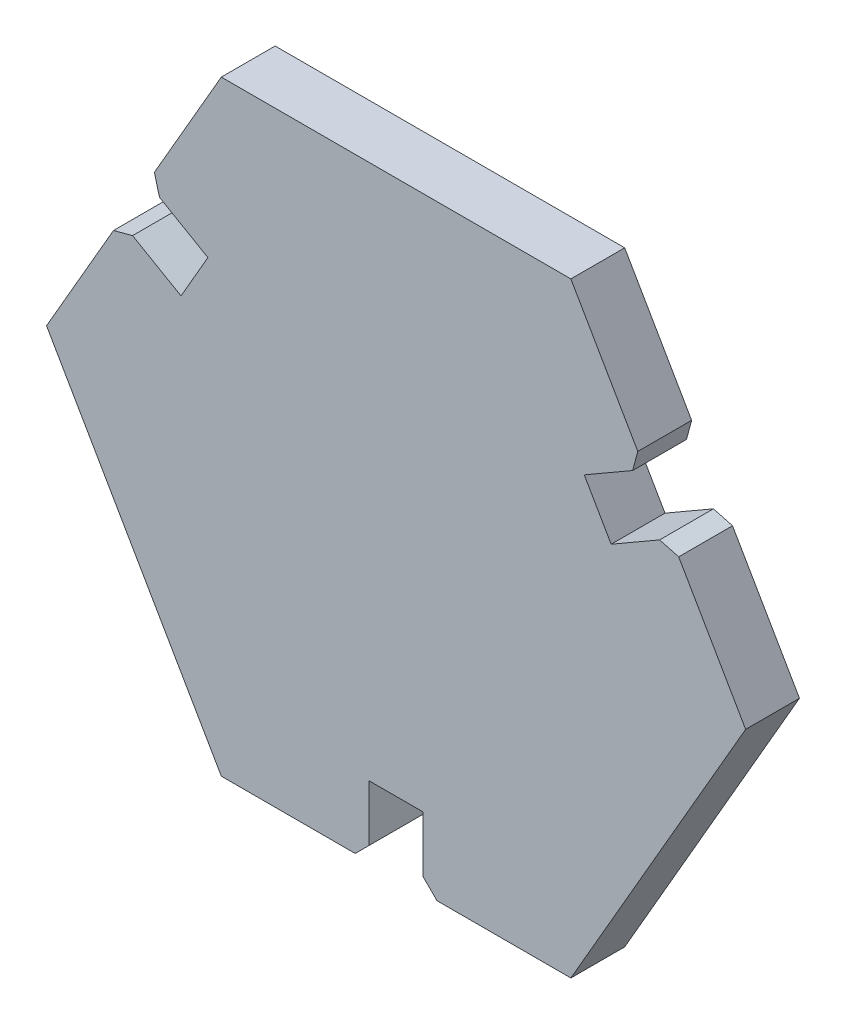
ISO-10303-21;
HEADER;
FILE_DESCRIPTION(('STEP AP214'),'2;1');
FILE_NAME('part.step','',(''),(''),'','','');
FILE_SCHEMA(('AUTOMOTIVE_DESIGN { 1 0 10303 214 1 1 1 1 }'));
ENDSEC;
DATA;
#1=APPLICATION_CONTEXT('core data for automotive mechanical design processes');
#2=APPLICATION_PROTOCOL_DEFINITION('international standard','automotive_design',2000,#1);
#3=PRODUCT_CONTEXT('',#1,'mechanical');
#4=PRODUCT('Part','Part','',(#3));
#5=PRODUCT_RELATED_PRODUCT_CATEGORY('part','',(#4));
#6=PRODUCT_DEFINITION_FORMATION('','',#4);
#7=PRODUCT_DEFINITION_CONTEXT('part definition',#1,'design');
#8=PRODUCT_DEFINITION('design','',#6,#7);
#9=PRODUCT_DEFINITION_SHAPE('','',#8);
#10=(LENGTH_UNIT() NAMED_UNIT(*) SI_UNIT(.MILLI.,.METRE.));
#11=(NAMED_UNIT(*) PLANE_ANGLE_UNIT() SI_UNIT($,.RADIAN.));
#12=(NAMED_UNIT(*) SI_UNIT($,.STERADIAN.) SOLID_ANGLE_UNIT());
#13=UNCERTAINTY_MEASURE_WITH_UNIT(LENGTH_MEASURE(1.E-05),#10,'distance_accuracy_value','');
#14=(GEOMETRIC_REPRESENTATION_CONTEXT(3) GLOBAL_UNCERTAINTY_ASSIGNED_CONTEXT((#13)) GLOBAL_UNIT_ASSIGNED_CONTEXT((#10,
#11,#12)) REPRESENTATION_CONTEXT('',''));
#15=CARTESIAN_POINT('',(0.,0.,0.));
#16=DIRECTION('',(0.,0.,1.));
#17=DIRECTION('',(1.,0.,0.));
#18=AXIS2_PLACEMENT_3D('',#15,#16,#17);
#19=CARTESIAN_POINT('',(12.5,-21.6506350946109,3.85));
#20=DIRECTION('',(-0.866025403784438,0.500000000000002,0.));
#21=DIRECTION('',(-0.500000000000002,-0.866025403784438,0.));
#22=AXIS2_PLACEMENT_3D('',#19,#20,#21);
#23=PLANE('',#22);
#24=DIRECTION('',(0.500000000000001,0.866025403784438,0.));
#25=VECTOR('',#24,1.);
#26=CARTESIAN_POINT('',(12.5,-21.6506350946109,0.));
#27=LINE('',#26,#25);
#28=CARTESIAN_POINT('',(12.5,-21.6506350946109,0.));
#29=VERTEX_POINT('',#28);
#30=CARTESIAN_POINT('',(25.,0.,0.));
#31=VERTEX_POINT('',#30);
#32=EDGE_CURVE('E219',#29,#31,#27,.T.);
#33=ORIENTED_EDGE('',*,*,#32,.T.);
#34=DIRECTION('',(0.,0.,-1.));
#35=VECTOR('',#34,1.);
#36=CARTESIAN_POINT('',(25.,0.,3.85));
#37=LINE('',#36,#35);
#38=CARTESIAN_POINT('',(25.,0.,3.85));
#39=VERTEX_POINT('',#38);
#40=EDGE_CURVE('E200',#39,#31,#37,.T.);
#41=ORIENTED_EDGE('',*,*,#40,.F.);
#42=DIRECTION('',(0.500000000000001,0.866025403784438,0.));
#43=VECTOR('',#42,1.);
#44=CARTESIAN_POINT('',(12.5,-21.6506350946109,3.85));
#45=LINE('',#44,#43);
#46=CARTESIAN_POINT('',(12.5,-21.6506350946109,3.85));
#47=VERTEX_POINT('',#46);
#48=EDGE_CURVE('E206',#47,#39,#45,.T.);
#49=ORIENTED_EDGE('',*,*,#48,.F.);
#50=DIRECTION('',(0.,0.,-1.));
#51=VECTOR('',#50,1.);
#52=CARTESIAN_POINT('',(12.5,-21.6506350946109,3.85));
#53=LINE('',#52,#51);
#54=EDGE_CURVE('E323',#47,#29,#53,.T.);
#55=ORIENTED_EDGE('',*,*,#54,.T.);
#56=EDGE_LOOP('',(#33,#41,#49,#55));
#57=FACE_BOUND('',#56,.T.);
#58=ADVANCED_FACE('F33',(#57),#23,.F.);
#59=CARTESIAN_POINT('',(25.,0.,3.85));
#60=DIRECTION('',(-0.866025403784439,-0.5,0.));
#61=DIRECTION('',(0.5,-0.866025403784439,0.));
#62=AXIS2_PLACEMENT_3D('',#59,#60,#61);
#63=PLANE('',#62);
#64=DIRECTION('',(-0.5,0.866025403784439,0.));
#65=VECTOR('',#64,1.);
#66=CARTESIAN_POINT('',(25.,0.,0.));
#67=LINE('',#66,#65);
#68=CARTESIAN_POINT('',(20.2125,8.29219324123599,0.));
#69=VERTEX_POINT('',#68);
#70=EDGE_CURVE('E360',#31,#69,#67,.T.);
#71=ORIENTED_EDGE('',*,*,#70,.T.);
#72=DIRECTION('',(0.,0.,1.));
#73=VECTOR('',#72,1.);
#74=CARTESIAN_POINT('',(20.2125,8.292193241236,3.85));
#75=LINE('',#74,#73);
#76=CARTESIAN_POINT('',(20.2125,8.29219324123599,3.85));
#77=VERTEX_POINT('',#76);
#78=EDGE_CURVE('E203',#69,#77,#75,.T.);
#79=ORIENTED_EDGE('',*,*,#78,.T.);
#80=DIRECTION('',(-0.5,0.866025403784439,0.));
#81=VECTOR('',#80,1.);
#82=CARTESIAN_POINT('',(25.,0.,3.85));
#83=LINE('',#82,#81);
#84=EDGE_CURVE('E195',#39,#77,#83,.T.);
#85=ORIENTED_EDGE('',*,*,#84,.F.);
#86=ORIENTED_EDGE('',*,*,#40,.T.);
#87=EDGE_LOOP('',(#71,#79,#85,#86));
#88=FACE_BOUND('',#87,.T.);
#89=ADVANCED_FACE('F198',(#88),#63,.F.);
#90=CARTESIAN_POINT('',(19.7125,9.15821864502044,3.85));
#91=DIRECTION('',(0.5,-0.866025403784438,0.));
#92=DIRECTION('',(0.866025403784439,0.5,0.));
#93=AXIS2_PLACEMENT_3D('',#90,#91,#92);
#94=PLANE('',#93);
#95=DIRECTION('',(-0.866025403784438,-0.5,0.));
#96=VECTOR('',#95,1.);
#97=CARTESIAN_POINT('',(19.7125,9.15821864502044,3.85));
#98=LINE('',#97,#96);
#99=CARTESIAN_POINT('',(18.8464745962156,8.65821864502044,3.85));
#100=VERTEX_POINT('',#99);
#101=CARTESIAN_POINT('',(15.3823729810778,6.65821864502044,3.85));
#102=VERTEX_POINT('',#101);
#103=EDGE_CURVE('E205',#100,#102,#98,.T.);
#104=ORIENTED_EDGE('',*,*,#103,.F.);
#105=DIRECTION('',(0.,0.,-1.));
#106=VECTOR('',#105,1.);
#107=CARTESIAN_POINT('',(18.8464745962156,8.65821864502044,3.85));
#108=LINE('',#107,#106);
#109=CARTESIAN_POINT('',(18.8464745962156,8.65821864502044,0.));
#110=VERTEX_POINT('',#109);
#111=EDGE_CURVE('E269',#100,#110,#108,.T.);
#112=ORIENTED_EDGE('',*,*,#111,.T.);
#113=DIRECTION('',(-0.866025403784438,-0.5,0.));
#114=VECTOR('',#113,1.);
#115=CARTESIAN_POINT('',(19.7125,9.15821864502044,0.));
#116=LINE('',#115,#114);
#117=CARTESIAN_POINT('',(15.3823729810778,6.65821864502044,0.));
#118=VERTEX_POINT('',#117);
#119=EDGE_CURVE('E359',#110,#118,#116,.T.);
#120=ORIENTED_EDGE('',*,*,#119,.T.);
#121=DIRECTION('',(0.,0.,-1.));
#122=VECTOR('',#121,1.);
#123=CARTESIAN_POINT('',(15.3823729810778,6.65821864502044,3.85));
#124=LINE('',#123,#122);
#125=EDGE_CURVE('E221',#102,#118,#124,.T.);
#126=ORIENTED_EDGE('',*,*,#125,.F.);
#127=EDGE_LOOP('',(#104,#112,#120,#126));
#128=FACE_BOUND('',#127,.T.);
#129=ADVANCED_FACE('F398',(#128),#94,.F.);
#130=CARTESIAN_POINT('',(13.4573729810778,9.99241644959053,3.85));
#131=DIRECTION('',(-0.866025403784439,-0.5,0.));
#132=DIRECTION('',(0.5,-0.866025403784439,0.));
#133=AXIS2_PLACEMENT_3D('',#130,#131,#132);
#134=PLANE('',#133);
#135=DIRECTION('',(-0.5,0.866025403784439,0.));
#136=VECTOR('',#135,1.);
#137=CARTESIAN_POINT('',(13.4573729810778,9.99241644959053,0.));
#138=LINE('',#137,#136);
#139=CARTESIAN_POINT('',(13.4573729810778,9.99241644959053,0.));
#140=VERTEX_POINT('',#139);
#141=EDGE_CURVE('E296',#118,#140,#138,.T.);
#142=ORIENTED_EDGE('',*,*,#141,.T.);
#143=DIRECTION('',(0.,0.,-1.));
#144=VECTOR('',#143,1.);
#145=CARTESIAN_POINT('',(13.4573729810778,9.99241644959053,3.85));
#146=LINE('',#145,#144);
#147=CARTESIAN_POINT('',(13.4573729810778,9.99241644959053,3.85));
#148=VERTEX_POINT('',#147);
#149=EDGE_CURVE('E227',#148,#140,#146,.T.);
#150=ORIENTED_EDGE('',*,*,#149,.F.);
#151=DIRECTION('',(-0.5,0.866025403784439,0.));
#152=VECTOR('',#151,1.);
#153=CARTESIAN_POINT('',(13.4573729810778,9.99241644959053,3.85));
#154=LINE('',#153,#152);
#155=EDGE_CURVE('E392',#102,#148,#154,.T.);
#156=ORIENTED_EDGE('',*,*,#155,.F.);
#157=ORIENTED_EDGE('',*,*,#125,.T.);
#158=EDGE_LOOP('',(#142,#150,#156,#157));
#159=FACE_BOUND('',#158,.T.);
#160=ADVANCED_FACE('F399',(#159),#134,.F.);
#161=CARTESIAN_POINT('',(17.7875,12.4924164495905,3.85));
#162=DIRECTION('',(-0.5,0.866025403784439,0.));
#163=DIRECTION('',(-0.866025403784439,-0.5,0.));
#164=AXIS2_PLACEMENT_3D('',#161,#162,#163);
#165=PLANE('',#164);
#166=DIRECTION('',(0.866025403784439,0.5,0.));
#167=VECTOR('',#166,1.);
#168=CARTESIAN_POINT('',(17.7875,12.4924164495905,0.));
#169=LINE('',#168,#167);
#170=CARTESIAN_POINT('',(16.9214745962156,11.9924164495905,0.));
#171=VERTEX_POINT('',#170);
#172=EDGE_CURVE('E292',#140,#171,#169,.T.);
#173=ORIENTED_EDGE('',*,*,#172,.T.);
#174=DIRECTION('',(0.,0.,1.));
#175=VECTOR('',#174,1.);
#176=CARTESIAN_POINT('',(16.9214745962156,11.9924164495905,3.85));
#177=LINE('',#176,#175);
#178=CARTESIAN_POINT('',(16.9214745962156,11.9924164495905,3.85));
#179=VERTEX_POINT('',#178);
#180=EDGE_CURVE('E11',#171,#179,#177,.T.);
#181=ORIENTED_EDGE('',*,*,#180,.T.);
#182=DIRECTION('',(0.866025403784439,0.5,0.));
#183=VECTOR('',#182,1.);
#184=CARTESIAN_POINT('',(17.7875,12.4924164495905,3.85));
#185=LINE('',#184,#183);
#186=EDGE_CURVE('E354',#148,#179,#185,.T.);
#187=ORIENTED_EDGE('',*,*,#186,.F.);
#188=ORIENTED_EDGE('',*,*,#149,.T.);
#189=EDGE_LOOP('',(#173,#181,#187,#188));
#190=FACE_BOUND('',#189,.T.);
#191=ADVANCED_FACE('F351',(#190),#165,.F.);
#192=CARTESIAN_POINT('',(12.5,21.650635094611,3.85));
#193=DIRECTION('',(-0.866025403784437,-0.500000000000002,0.));
#194=DIRECTION('',(0.500000000000002,-0.866025403784437,0.));
#195=AXIS2_PLACEMENT_3D('',#192,#193,#194);
#196=PLANE('',#195);
#197=DIRECTION('',(-0.500000000000002,0.866025403784437,0.));
#198=VECTOR('',#197,1.);
#199=CARTESIAN_POINT('',(12.5,21.650635094611,3.85));
#200=LINE('',#199,#198);
#201=CARTESIAN_POINT('',(17.2875,13.358441853375,3.85));
#202=VERTEX_POINT('',#201);
#203=CARTESIAN_POINT('',(12.5,21.650635094611,3.85));
#204=VERTEX_POINT('',#203);
#205=EDGE_CURVE('E281',#202,#204,#200,.T.);
#206=ORIENTED_EDGE('',*,*,#205,.F.);
#207=DIRECTION('',(0.,0.,-1.));
#208=VECTOR('',#207,1.);
#209=CARTESIAN_POINT('',(17.2875,13.358441853375,3.85));
#210=LINE('',#209,#208);
#211=CARTESIAN_POINT('',(17.2875,13.358441853375,0.));
#212=VERTEX_POINT('',#211);
#213=EDGE_CURVE('E41',#202,#212,#210,.T.);
#214=ORIENTED_EDGE('',*,*,#213,.T.);
#215=DIRECTION('',(-0.500000000000002,0.866025403784437,0.));
#216=VECTOR('',#215,1.);
#217=CARTESIAN_POINT('',(12.5,21.650635094611,0.));
#218=LINE('',#217,#216);
#219=CARTESIAN_POINT('',(12.5,21.650635094611,0.));
#220=VERTEX_POINT('',#219);
#221=EDGE_CURVE('E279',#212,#220,#218,.T.);
#222=ORIENTED_EDGE('',*,*,#221,.T.);
#223=DIRECTION('',(0.,0.,-1.));
#224=VECTOR('',#223,1.);
#225=CARTESIAN_POINT('',(12.5,21.650635094611,3.85));
#226=LINE('',#225,#224);
#227=EDGE_CURVE('E346',#204,#220,#226,.T.);
#228=ORIENTED_EDGE('',*,*,#227,.F.);
#229=EDGE_LOOP('',(#206,#214,#222,#228));
#230=FACE_BOUND('',#229,.T.);
#231=ADVANCED_FACE('F277',(#230),#196,.F.);
#232=CARTESIAN_POINT('',(-12.5,21.6506350946109,3.85));
#233=DIRECTION('',(0.,-1.,0.));
#234=DIRECTION('',(1.,0.,0.));
#235=AXIS2_PLACEMENT_3D('',#232,#233,#234);
#236=PLANE('',#235);
#237=DIRECTION('',(-1.,0.,0.));
#238=VECTOR('',#237,1.);
#239=CARTESIAN_POINT('',(-12.5,21.6506350946109,0.));
#240=LINE('',#239,#238);
#241=CARTESIAN_POINT('',(-12.5,21.6506350946109,0.));
#242=VERTEX_POINT('',#241);
#243=EDGE_CURVE('E291',#220,#242,#240,.T.);
#244=ORIENTED_EDGE('',*,*,#243,.T.);
#245=DIRECTION('',(0.,0.,-1.));
#246=VECTOR('',#245,1.);
#247=CARTESIAN_POINT('',(-12.5,21.6506350946109,3.85));
#248=LINE('',#247,#246);
#249=CARTESIAN_POINT('',(-12.5,21.6506350946109,3.85));
#250=VERTEX_POINT('',#249);
#251=EDGE_CURVE('E343',#250,#242,#248,.T.);
#252=ORIENTED_EDGE('',*,*,#251,.F.);
#253=DIRECTION('',(-1.,0.,0.));
#254=VECTOR('',#253,1.);
#255=CARTESIAN_POINT('',(-12.5,21.6506350946109,3.85));
#256=LINE('',#255,#254);
#257=EDGE_CURVE('E388',#204,#250,#256,.T.);
#258=ORIENTED_EDGE('',*,*,#257,.F.);
#259=ORIENTED_EDGE('',*,*,#227,.T.);
#260=EDGE_LOOP('',(#244,#252,#258,#259));
#261=FACE_BOUND('',#260,.T.);
#262=ADVANCED_FACE('F490',(#261),#236,.F.);
#263=CARTESIAN_POINT('',(-12.5,21.6506350946109,3.85));
#264=DIRECTION('',(0.866025403784438,-0.500000000000001,0.));
#265=DIRECTION('',(0.500000000000001,0.866025403784438,0.));
#266=AXIS2_PLACEMENT_3D('',#263,#264,#265);
#267=PLANE('',#266);
#268=DIRECTION('',(-0.500000000000001,-0.866025403784438,0.));
#269=VECTOR('',#268,1.);
#270=CARTESIAN_POINT('',(-12.5,21.6506350946109,0.));
#271=LINE('',#270,#269);
#272=CARTESIAN_POINT('',(-17.2875,13.358441853375,0.));
#273=VERTEX_POINT('',#272);
#274=EDGE_CURVE('E294',#242,#273,#271,.T.);
#275=ORIENTED_EDGE('',*,*,#274,.T.);
#276=DIRECTION('',(0.,0.,1.));
#277=VECTOR('',#276,1.);
#278=CARTESIAN_POINT('',(-17.2875,13.358441853375,3.85));
#279=LINE('',#278,#277);
#280=CARTESIAN_POINT('',(-17.2875,13.358441853375,3.85));
#281=VERTEX_POINT('',#280);
#282=EDGE_CURVE('E267',#273,#281,#279,.T.);
#283=ORIENTED_EDGE('',*,*,#282,.T.);
#284=DIRECTION('',(-0.500000000000001,-0.866025403784438,0.));
#285=VECTOR('',#284,1.);
#286=CARTESIAN_POINT('',(-12.5,21.6506350946109,3.85));
#287=LINE('',#286,#285);
#288=EDGE_CURVE('E385',#250,#281,#287,.T.);
#289=ORIENTED_EDGE('',*,*,#288,.F.);
#290=ORIENTED_EDGE('',*,*,#251,.T.);
#291=EDGE_LOOP('',(#275,#283,#289,#290));
#292=FACE_BOUND('',#291,.T.);
#293=ADVANCED_FACE('F486',(#292),#267,.F.);
#294=CARTESIAN_POINT('',(-17.7875,12.4924164495905,3.85));
#295=DIRECTION('',(0.499999999999999,0.866025403784439,0.));
#296=DIRECTION('',(-0.866025403784439,0.499999999999999,0.));
#297=AXIS2_PLACEMENT_3D('',#294,#295,#296);
#298=PLANE('',#297);
#299=DIRECTION('',(0.866025403784439,-0.499999999999999,0.));
#300=VECTOR('',#299,1.);
#301=CARTESIAN_POINT('',(-17.7875,12.4924164495905,3.85));
#302=LINE('',#301,#300);
#303=CARTESIAN_POINT('',(-16.9214745962156,11.9924164495905,3.85));
#304=VERTEX_POINT('',#303);
#305=CARTESIAN_POINT('',(-13.4573729810778,9.99241644959054,3.85));
#306=VERTEX_POINT('',#305);
#307=EDGE_CURVE('E383',#304,#306,#302,.T.);
#308=ORIENTED_EDGE('',*,*,#307,.F.);
#309=DIRECTION('',(0.,0.,-1.));
#310=VECTOR('',#309,1.);
#311=CARTESIAN_POINT('',(-16.9214745962156,11.9924164495905,3.85));
#312=LINE('',#311,#310);
#313=CARTESIAN_POINT('',(-16.9214745962156,11.9924164495905,0.));
#314=VERTEX_POINT('',#313);
#315=EDGE_CURVE('E264',#304,#314,#312,.T.);
#316=ORIENTED_EDGE('',*,*,#315,.T.);
#317=DIRECTION('',(0.866025403784439,-0.499999999999999,0.));
#318=VECTOR('',#317,1.);
#319=CARTESIAN_POINT('',(-17.7875,12.4924164495905,0.));
#320=LINE('',#319,#318);
#321=CARTESIAN_POINT('',(-13.4573729810778,9.99241644959054,0.));
#322=VERTEX_POINT('',#321);
#323=EDGE_CURVE('E302',#314,#322,#320,.T.);
#324=ORIENTED_EDGE('',*,*,#323,.T.);
#325=DIRECTION('',(0.,0.,-1.));
#326=VECTOR('',#325,1.);
#327=CARTESIAN_POINT('',(-13.4573729810778,9.99241644959054,3.85));
#328=LINE('',#327,#326);
#329=EDGE_CURVE('E340',#306,#322,#328,.T.);
#330=ORIENTED_EDGE('',*,*,#329,.F.);
#331=EDGE_LOOP('',(#308,#316,#324,#330));
#332=FACE_BOUND('',#331,.T.);
#333=ADVANCED_FACE('F482',(#332),#298,.F.);
#334=CARTESIAN_POINT('',(-15.3823729810778,6.65821864502045,3.85));
#335=DIRECTION('',(0.866025403784439,-0.499999999999999,0.));
#336=DIRECTION('',(0.5,0.866025403784439,0.));
#337=AXIS2_PLACEMENT_3D('',#334,#335,#336);
#338=PLANE('',#337);
#339=DIRECTION('',(-0.5,-0.866025403784439,0.));
#340=VECTOR('',#339,1.);
#341=CARTESIAN_POINT('',(-15.3823729810778,6.65821864502045,0.));
#342=LINE('',#341,#340);
#343=CARTESIAN_POINT('',(-15.3823729810778,6.65821864502045,0.));
#344=VERTEX_POINT('',#343);
#345=EDGE_CURVE('E304',#322,#344,#342,.T.);
#346=ORIENTED_EDGE('',*,*,#345,.T.);
#347=DIRECTION('',(0.,0.,-1.));
#348=VECTOR('',#347,1.);
#349=CARTESIAN_POINT('',(-15.3823729810778,6.65821864502045,3.85));
#350=LINE('',#349,#348);
#351=CARTESIAN_POINT('',(-15.3823729810778,6.65821864502045,3.85));
#352=VERTEX_POINT('',#351);
#353=EDGE_CURVE('E337',#352,#344,#350,.T.);
#354=ORIENTED_EDGE('',*,*,#353,.F.);
#355=DIRECTION('',(-0.5,-0.866025403784439,0.));
#356=VECTOR('',#355,1.);
#357=CARTESIAN_POINT('',(-15.3823729810778,6.65821864502045,3.85));
#358=LINE('',#357,#356);
#359=EDGE_CURVE('E381',#306,#352,#358,.T.);
#360=ORIENTED_EDGE('',*,*,#359,.F.);
#361=ORIENTED_EDGE('',*,*,#329,.T.);
#362=EDGE_LOOP('',(#346,#354,#360,#361));
#363=FACE_BOUND('',#362,.T.);
#364=ADVANCED_FACE('F478',(#363),#338,.F.);
#365=CARTESIAN_POINT('',(-19.7125,9.15821864502045,3.85));
#366=DIRECTION('',(-0.5,-0.866025403784439,0.));
#367=DIRECTION('',(0.866025403784439,-0.5,0.));
#368=AXIS2_PLACEMENT_3D('',#365,#366,#367);
#369=PLANE('',#368);
#370=DIRECTION('',(-0.866025403784439,0.5,0.));
#371=VECTOR('',#370,1.);
#372=CARTESIAN_POINT('',(-19.7125,9.15821864502045,0.));
#373=LINE('',#372,#371);
#374=CARTESIAN_POINT('',(-18.8464745962155,8.65821864502044,0.));
#375=VERTEX_POINT('',#374);
#376=EDGE_CURVE('E306',#344,#375,#373,.T.);
#377=ORIENTED_EDGE('',*,*,#376,.T.);
#378=DIRECTION('',(0.,0.,1.));
#379=VECTOR('',#378,1.);
#380=CARTESIAN_POINT('',(-18.8464745962155,8.65821864502044,3.85));
#381=LINE('',#380,#379);
#382=CARTESIAN_POINT('',(-18.8464745962155,8.65821864502044,3.85));
#383=VERTEX_POINT('',#382);
#384=EDGE_CURVE('E262',#375,#383,#381,.T.);
#385=ORIENTED_EDGE('',*,*,#384,.T.);
#386=DIRECTION('',(-0.866025403784439,0.5,0.));
#387=VECTOR('',#386,1.);
#388=CARTESIAN_POINT('',(-19.7125,9.15821864502045,3.85));
#389=LINE('',#388,#387);
#390=EDGE_CURVE('E378',#352,#383,#389,.T.);
#391=ORIENTED_EDGE('',*,*,#390,.F.);
#392=ORIENTED_EDGE('',*,*,#353,.T.);
#393=EDGE_LOOP('',(#377,#385,#391,#392));
#394=FACE_BOUND('',#393,.T.);
#395=ADVANCED_FACE('F474',(#394),#369,.F.);
#396=CARTESIAN_POINT('',(-25.,0.,3.85));
#397=DIRECTION('',(0.86602540378444,-0.499999999999997,0.));
#398=DIRECTION('',(0.499999999999997,0.86602540378444,0.));
#399=AXIS2_PLACEMENT_3D('',#396,#397,#398);
#400=PLANE('',#399);
#401=DIRECTION('',(-0.499999999999997,-0.86602540378444,0.));
#402=VECTOR('',#401,1.);
#403=CARTESIAN_POINT('',(-25.,0.,3.85));
#404=LINE('',#403,#402);
#405=CARTESIAN_POINT('',(-20.2125,8.292193241236,3.85));
#406=VERTEX_POINT('',#405);
#407=CARTESIAN_POINT('',(-25.,0.,3.85));
#408=VERTEX_POINT('',#407);
#409=EDGE_CURVE('E376',#406,#408,#404,.T.);
#410=ORIENTED_EDGE('',*,*,#409,.F.);
#411=DIRECTION('',(0.,0.,-1.));
#412=VECTOR('',#411,1.);
#413=CARTESIAN_POINT('',(-20.2125,8.292193241236,3.85));
#414=LINE('',#413,#412);
#415=CARTESIAN_POINT('',(-20.2125,8.292193241236,0.));
#416=VERTEX_POINT('',#415);
#417=EDGE_CURVE('E259',#406,#416,#414,.T.);
#418=ORIENTED_EDGE('',*,*,#417,.T.);
#419=DIRECTION('',(-0.499999999999997,-0.86602540378444,0.));
#420=VECTOR('',#419,1.);
#421=CARTESIAN_POINT('',(-25.,0.,0.));
#422=LINE('',#421,#420);
#423=CARTESIAN_POINT('',(-25.,0.,0.));
#424=VERTEX_POINT('',#423);
#425=EDGE_CURVE('E309',#416,#424,#422,.T.);
#426=ORIENTED_EDGE('',*,*,#425,.T.);
#427=DIRECTION('',(0.,0.,-1.));
#428=VECTOR('',#427,1.);
#429=CARTESIAN_POINT('',(-25.,0.,3.85));
#430=LINE('',#429,#428);
#431=EDGE_CURVE('E334',#408,#424,#430,.T.);
#432=ORIENTED_EDGE('',*,*,#431,.F.);
#433=EDGE_LOOP('',(#410,#418,#426,#432));
#434=FACE_BOUND('',#433,.T.);
#435=ADVANCED_FACE('F470',(#434),#400,.F.);
#436=CARTESIAN_POINT('',(-25.,0.,3.85));
#437=DIRECTION('',(0.866025403784438,0.500000000000001,0.));
#438=DIRECTION('',(-0.500000000000001,0.866025403784438,0.));
#439=AXIS2_PLACEMENT_3D('',#436,#437,#438);
#440=PLANE('',#439);
#441=DIRECTION('',(0.500000000000001,-0.866025403784438,0.));
#442=VECTOR('',#441,1.);
#443=CARTESIAN_POINT('',(-25.,0.,0.));
#444=LINE('',#443,#442);
#445=CARTESIAN_POINT('',(-12.5,-21.6506350946109,0.));
#446=VERTEX_POINT('',#445);
#447=EDGE_CURVE('E311',#424,#446,#444,.T.);
#448=ORIENTED_EDGE('',*,*,#447,.T.);
#449=DIRECTION('',(0.,0.,-1.));
#450=VECTOR('',#449,1.);
#451=CARTESIAN_POINT('',(-12.5,-21.6506350946109,3.85));
#452=LINE('',#451,#450);
#453=CARTESIAN_POINT('',(-12.5,-21.6506350946109,3.85));
#454=VERTEX_POINT('',#453);
#455=EDGE_CURVE('E331',#454,#446,#452,.T.);
#456=ORIENTED_EDGE('',*,*,#455,.F.);
#457=DIRECTION('',(0.500000000000001,-0.866025403784438,0.));
#458=VECTOR('',#457,1.);
#459=CARTESIAN_POINT('',(-25.,0.,3.85));
#460=LINE('',#459,#458);
#461=EDGE_CURVE('E374',#408,#454,#460,.T.);
#462=ORIENTED_EDGE('',*,*,#461,.F.);
#463=ORIENTED_EDGE('',*,*,#431,.T.);
#464=EDGE_LOOP('',(#448,#456,#462,#463));
#465=FACE_BOUND('',#464,.T.);
#466=ADVANCED_FACE('F464',(#465),#440,.F.);
#467=CARTESIAN_POINT('',(-12.5,-21.6506350946109,3.85));
#468=DIRECTION('',(0.,1.,0.));
#469=DIRECTION('',(-1.,0.,0.));
#470=AXIS2_PLACEMENT_3D('',#467,#468,#469);
#471=PLANE('',#470);
#472=DIRECTION('',(1.,0.,0.));
#473=VECTOR('',#472,1.);
#474=CARTESIAN_POINT('',(-12.5,-21.6506350946109,0.));
#475=LINE('',#474,#473);
#476=CARTESIAN_POINT('',(-2.92500000000001,-21.650635094611,0.));
#477=VERTEX_POINT('',#476);
#478=EDGE_CURVE('E313',#446,#477,#475,.T.);
#479=ORIENTED_EDGE('',*,*,#478,.T.);
#480=DIRECTION('',(0.,0.,1.));
#481=VECTOR('',#480,1.);
#482=CARTESIAN_POINT('',(-2.92500000000001,-21.650635094611,3.85));
#483=LINE('',#482,#481);
#484=CARTESIAN_POINT('',(-2.92500000000001,-21.650635094611,3.85));
#485=VERTEX_POINT('',#484);
#486=EDGE_CURVE('E56',#477,#485,#483,.T.);
#487=ORIENTED_EDGE('',*,*,#486,.T.);
#488=DIRECTION('',(1.,0.,0.));
#489=VECTOR('',#488,1.);
#490=CARTESIAN_POINT('',(-12.5,-21.6506350946109,3.85));
#491=LINE('',#490,#489);
#492=EDGE_CURVE('E372',#454,#485,#491,.T.);
#493=ORIENTED_EDGE('',*,*,#492,.F.);
#494=ORIENTED_EDGE('',*,*,#455,.T.);
#495=EDGE_LOOP('',(#479,#487,#493,#494));
#496=FACE_BOUND('',#495,.T.);
#497=ADVANCED_FACE('F457',(#496),#471,.F.);
#498=CARTESIAN_POINT('',(-1.925,-21.650635094611,3.85));
#499=DIRECTION('',(-1.,0.,0.));
#500=DIRECTION('',(0.,-1.,0.));
#501=AXIS2_PLACEMENT_3D('',#498,#499,#500);
#502=PLANE('',#501);
#503=DIRECTION('',(0.,1.,0.));
#504=VECTOR('',#503,1.);
#505=CARTESIAN_POINT('',(-1.925,-21.650635094611,3.85));
#506=LINE('',#505,#504);
#507=CARTESIAN_POINT('',(-1.92500000000001,-20.650635094611,3.85));
#508=VERTEX_POINT('',#507);
#509=CARTESIAN_POINT('',(-1.92500000000001,-16.650635094611,3.85));
#510=VERTEX_POINT('',#509);
#511=EDGE_CURVE('E370',#508,#510,#506,.T.);
#512=ORIENTED_EDGE('',*,*,#511,.F.);
#513=DIRECTION('',(0.,0.,-1.));
#514=VECTOR('',#513,1.);
#515=CARTESIAN_POINT('',(-1.92500000000001,-20.650635094611,3.85));
#516=LINE('',#515,#514);
#517=CARTESIAN_POINT('',(-1.92500000000001,-20.650635094611,0.));
#518=VERTEX_POINT('',#517);
#519=EDGE_CURVE('E255',#508,#518,#516,.T.);
#520=ORIENTED_EDGE('',*,*,#519,.T.);
#521=DIRECTION('',(0.,1.,0.));
#522=VECTOR('',#521,1.);
#523=CARTESIAN_POINT('',(-1.925,-21.650635094611,0.));
#524=LINE('',#523,#522);
#525=CARTESIAN_POINT('',(-1.92500000000001,-16.650635094611,0.));
#526=VERTEX_POINT('',#525);
#527=EDGE_CURVE('E315',#518,#526,#524,.T.);
#528=ORIENTED_EDGE('',*,*,#527,.T.);
#529=DIRECTION('',(0.,0.,-1.));
#530=VECTOR('',#529,1.);
#531=CARTESIAN_POINT('',(-1.92500000000001,-16.650635094611,3.85));
#532=LINE('',#531,#530);
#533=EDGE_CURVE('E328',#510,#526,#532,.T.);
#534=ORIENTED_EDGE('',*,*,#533,.F.);
#535=EDGE_LOOP('',(#512,#520,#528,#534));
#536=FACE_BOUND('',#535,.T.);
#537=ADVANCED_FACE('F454',(#536),#502,.F.);
#538=CARTESIAN_POINT('',(1.92499999999999,-16.650635094611,3.85));
#539=DIRECTION('',(0.,1.,0.));
#540=DIRECTION('',(0.,0.,1.));
#541=AXIS2_PLACEMENT_3D('',#538,#539,#540);
#542=PLANE('',#541);
#543=DIRECTION('',(1.,0.,0.));
#544=VECTOR('',#543,1.);
#545=CARTESIAN_POINT('',(1.92499999999999,-16.650635094611,0.));
#546=LINE('',#545,#544);
#547=CARTESIAN_POINT('',(1.92499999999999,-16.650635094611,0.));
#548=VERTEX_POINT('',#547);
#549=EDGE_CURVE('E317',#526,#548,#546,.T.);
#550=ORIENTED_EDGE('',*,*,#549,.T.);
#551=DIRECTION('',(0.,0.,-1.));
#552=VECTOR('',#551,1.);
#553=CARTESIAN_POINT('',(1.92499999999999,-16.650635094611,3.85));
#554=LINE('',#553,#552);
#555=CARTESIAN_POINT('',(1.92499999999999,-16.650635094611,3.85));
#556=VERTEX_POINT('',#555);
#557=EDGE_CURVE('E325',#556,#548,#554,.T.);
#558=ORIENTED_EDGE('',*,*,#557,.F.);
#559=DIRECTION('',(1.,0.,0.));
#560=VECTOR('',#559,1.);
#561=CARTESIAN_POINT('',(1.92499999999999,-16.650635094611,3.85));
#562=LINE('',#561,#560);
#563=EDGE_CURVE('E368',#510,#556,#562,.T.);
#564=ORIENTED_EDGE('',*,*,#563,.F.);
#565=ORIENTED_EDGE('',*,*,#533,.T.);
#566=EDGE_LOOP('',(#550,#558,#564,#565));
#567=FACE_BOUND('',#566,.T.);
#568=ADVANCED_FACE('F449',(#567),#542,.F.);
#569=CARTESIAN_POINT('',(1.92499999999999,-21.6506350946109,3.85));
#570=DIRECTION('',(1.,0.,0.));
#571=DIRECTION('',(0.,1.,0.));
#572=AXIS2_PLACEMENT_3D('',#569,#570,#571);
#573=PLANE('',#572);
#574=DIRECTION('',(0.,-1.,0.));
#575=VECTOR('',#574,1.);
#576=CARTESIAN_POINT('',(1.92499999999999,-21.6506350946109,0.));
#577=LINE('',#576,#575);
#578=CARTESIAN_POINT('',(1.92499999999999,-20.6506350946109,0.));
#579=VERTEX_POINT('',#578);
#580=EDGE_CURVE('E319',#548,#579,#577,.T.);
#581=ORIENTED_EDGE('',*,*,#580,.T.);
#582=DIRECTION('',(0.,0.,1.));
#583=VECTOR('',#582,1.);
#584=CARTESIAN_POINT('',(1.92499999999999,-20.6506350946109,3.85));
#585=LINE('',#584,#583);
#586=CARTESIAN_POINT('',(1.92499999999999,-20.6506350946109,3.85));
#587=VERTEX_POINT('',#586);
#588=EDGE_CURVE('E242',#579,#587,#585,.T.);
#589=ORIENTED_EDGE('',*,*,#588,.T.);
#590=DIRECTION('',(0.,-1.,0.));
#591=VECTOR('',#590,1.);
#592=CARTESIAN_POINT('',(1.92499999999999,-21.6506350946109,3.85));
#593=LINE('',#592,#591);
#594=EDGE_CURVE('E366',#556,#587,#593,.T.);
#595=ORIENTED_EDGE('',*,*,#594,.F.);
#596=ORIENTED_EDGE('',*,*,#557,.T.);
#597=EDGE_LOOP('',(#581,#589,#595,#596));
#598=FACE_BOUND('',#597,.T.);
#599=ADVANCED_FACE('F444',(#598),#573,.F.);
#600=CARTESIAN_POINT('',(12.5,-21.6506350946109,3.85));
#601=DIRECTION('',(0.,1.,0.));
#602=DIRECTION('',(0.,0.,1.));
#603=AXIS2_PLACEMENT_3D('',#600,#601,#602);
#604=PLANE('',#603);
#605=DIRECTION('',(1.,0.,0.));
#606=VECTOR('',#605,1.);
#607=CARTESIAN_POINT('',(12.5,-21.6506350946109,3.85));
#608=LINE('',#607,#606);
#609=CARTESIAN_POINT('',(2.92499999999999,-21.6506350946109,3.85));
#610=VERTEX_POINT('',#609);
#611=EDGE_CURVE('E212',#610,#47,#608,.T.);
#612=ORIENTED_EDGE('',*,*,#611,.F.);
#613=DIRECTION('',(0.,0.,-1.));
#614=VECTOR('',#613,1.);
#615=CARTESIAN_POINT('',(2.92499999999999,-21.6506350946109,3.85));
#616=LINE('',#615,#614);
#617=CARTESIAN_POINT('',(2.92499999999999,-21.6506350946109,0.));
#618=VERTEX_POINT('',#617);
#619=EDGE_CURVE('E220',#610,#618,#616,.T.);
#620=ORIENTED_EDGE('',*,*,#619,.T.);
#621=DIRECTION('',(1.,0.,0.));
#622=VECTOR('',#621,1.);
#623=CARTESIAN_POINT('',(12.5,-21.6506350946109,0.));
#624=LINE('',#623,#622);
#625=EDGE_CURVE('E216',#618,#29,#624,.T.);
#626=ORIENTED_EDGE('',*,*,#625,.T.);
#627=ORIENTED_EDGE('',*,*,#54,.F.);
#628=EDGE_LOOP('',(#612,#620,#626,#627));
#629=FACE_BOUND('',#628,.T.);
#630=ADVANCED_FACE('F438',(#629),#604,.F.);
#631=CARTESIAN_POINT('',(0.,0.,3.85));
#632=DIRECTION('',(0.,0.,-1.));
#633=DIRECTION('',(-1.,0.,0.));
#634=AXIS2_PLACEMENT_3D('',#631,#632,#633);
#635=PLANE('',#634);
#636=ORIENTED_EDGE('',*,*,#594,.T.);
#637=DIRECTION('',(-0.707106781186545,0.70710678118655,0.));
#638=VECTOR('',#637,1.);
#639=CARTESIAN_POINT('',(2.92499999999999,-21.6506350946109,3.85));
#640=LINE('',#639,#638);
#641=EDGE_CURVE('E253',#587,#610,#640,.F.);
#642=ORIENTED_EDGE('',*,*,#641,.T.);
#643=ORIENTED_EDGE('',*,*,#611,.T.);
#644=ORIENTED_EDGE('',*,*,#48,.T.);
#645=ORIENTED_EDGE('',*,*,#84,.T.);
#646=DIRECTION('',(0.965925826289067,-0.258819045102525,0.));
#647=VECTOR('',#646,1.);
#648=CARTESIAN_POINT('',(18.8464745962156,8.65821864502044,3.85));
#649=LINE('',#648,#647);
#650=EDGE_CURVE('E246',#77,#100,#649,.F.);
#651=ORIENTED_EDGE('',*,*,#650,.T.);
#652=ORIENTED_EDGE('',*,*,#103,.T.);
#653=ORIENTED_EDGE('',*,*,#155,.T.);
#654=ORIENTED_EDGE('',*,*,#186,.T.);
#655=DIRECTION('',(-0.258819045102525,-0.965925826289067,0.));
#656=VECTOR('',#655,1.);
#657=CARTESIAN_POINT('',(17.2875,13.358441853375,3.85));
#658=LINE('',#657,#656);
#659=EDGE_CURVE('E244',#179,#202,#658,.F.);
#660=ORIENTED_EDGE('',*,*,#659,.T.);
#661=ORIENTED_EDGE('',*,*,#205,.T.);
#662=ORIENTED_EDGE('',*,*,#257,.T.);
#663=ORIENTED_EDGE('',*,*,#288,.T.);
#664=DIRECTION('',(-0.258819045102519,0.965925826289069,0.));
#665=VECTOR('',#664,1.);
#666=CARTESIAN_POINT('',(-16.9214745962156,11.9924164495905,3.85));
#667=LINE('',#666,#665);
#668=EDGE_CURVE('E248',#281,#304,#667,.F.);
#669=ORIENTED_EDGE('',*,*,#668,.T.);
#670=ORIENTED_EDGE('',*,*,#307,.T.);
#671=ORIENTED_EDGE('',*,*,#359,.T.);
#672=ORIENTED_EDGE('',*,*,#390,.T.);
#673=DIRECTION('',(0.965925826289069,0.258819045102517,0.));
#674=VECTOR('',#673,1.);
#675=CARTESIAN_POINT('',(-20.2125,8.292193241236,3.85));
#676=LINE('',#675,#674);
#677=EDGE_CURVE('E250',#383,#406,#676,.F.);
#678=ORIENTED_EDGE('',*,*,#677,.T.);
#679=ORIENTED_EDGE('',*,*,#409,.T.);
#680=ORIENTED_EDGE('',*,*,#461,.T.);
#681=ORIENTED_EDGE('',*,*,#492,.T.);
#682=DIRECTION('',(-0.707106781186551,-0.707106781186545,0.));
#683=VECTOR('',#682,1.);
#684=CARTESIAN_POINT('',(-1.92500000000001,-20.650635094611,3.85));
#685=LINE('',#684,#683);
#686=EDGE_CURVE('E48',#485,#508,#685,.F.);
#687=ORIENTED_EDGE('',*,*,#686,.T.);
#688=ORIENTED_EDGE('',*,*,#511,.T.);
#689=ORIENTED_EDGE('',*,*,#563,.T.);
#690=EDGE_LOOP('',(#636,#642,#643,#644,#645,#651,#652,#653,#654,#660,#661,#662,#663,#669,#670,
#671,#672,#678,#679,#680,#681,#687,#688,#689));
#691=FACE_BOUND('',#690,.T.);
#692=ADVANCED_FACE('F210',(#691),#635,.F.);
#693=CARTESIAN_POINT('',(0.,0.,0.));
#694=DIRECTION('',(0.,0.,-1.));
#695=DIRECTION('',(-1.,0.,0.));
#696=AXIS2_PLACEMENT_3D('',#693,#694,#695);
#697=PLANE('',#696);
#698=ORIENTED_EDGE('',*,*,#625,.F.);
#699=DIRECTION('',(0.707106781186545,-0.70710678118655,0.));
#700=VECTOR('',#699,1.);
#701=CARTESIAN_POINT('',(-9.36281754730547,-9.36281754730541,0.));
#702=LINE('',#701,#700);
#703=EDGE_CURVE('E240',#618,#579,#702,.F.);
#704=ORIENTED_EDGE('',*,*,#703,.T.);
#705=ORIENTED_EDGE('',*,*,#580,.F.);
#706=ORIENTED_EDGE('',*,*,#549,.F.);
#707=ORIENTED_EDGE('',*,*,#527,.F.);
#708=DIRECTION('',(0.707106781186551,0.707106781186545,0.));
#709=VECTOR('',#708,1.);
#710=CARTESIAN_POINT('',(9.36281754730548,-9.36281754730556,0.));
#711=LINE('',#710,#709);
#712=EDGE_CURVE('E238',#518,#477,#711,.F.);
#713=ORIENTED_EDGE('',*,*,#712,.T.);
#714=ORIENTED_EDGE('',*,*,#478,.F.);
#715=ORIENTED_EDGE('',*,*,#447,.F.);
#716=ORIENTED_EDGE('',*,*,#425,.F.);
#717=DIRECTION('',(-0.965925826289069,-0.258819045102517,0.));
#718=VECTOR('',#717,1.);
#719=CARTESIAN_POINT('',(-3.42702907331245,12.789846620618,0.));
#720=LINE('',#719,#718);
#721=EDGE_CURVE('E236',#416,#375,#720,.F.);
#722=ORIENTED_EDGE('',*,*,#721,.T.);
#723=ORIENTED_EDGE('',*,*,#376,.F.);
#724=ORIENTED_EDGE('',*,*,#345,.F.);
#725=ORIENTED_EDGE('',*,*,#323,.F.);
#726=DIRECTION('',(0.258819045102519,-0.965925826289069,0.));
#727=VECTOR('',#726,1.);
#728=CARTESIAN_POINT('',(-12.789846620618,-3.4270290733125,0.));
#729=LINE('',#728,#727);
#730=EDGE_CURVE('E234',#314,#273,#729,.F.);
#731=ORIENTED_EDGE('',*,*,#730,.T.);
#732=ORIENTED_EDGE('',*,*,#274,.F.);
#733=ORIENTED_EDGE('',*,*,#243,.F.);
#734=ORIENTED_EDGE('',*,*,#221,.F.);
#735=DIRECTION('',(0.258819045102525,0.965925826289067,0.));
#736=VECTOR('',#735,1.);
#737=CARTESIAN_POINT('',(12.7898466206179,-3.42702907331255,0.));
#738=LINE('',#737,#736);
#739=EDGE_CURVE('E224',#212,#171,#738,.F.);
#740=ORIENTED_EDGE('',*,*,#739,.T.);
#741=ORIENTED_EDGE('',*,*,#172,.F.);
#742=ORIENTED_EDGE('',*,*,#141,.F.);
#743=ORIENTED_EDGE('',*,*,#119,.F.);
#744=DIRECTION('',(-0.965925826289067,0.258819045102525,0.));
#745=VECTOR('',#744,1.);
#746=CARTESIAN_POINT('',(3.42702907331259,12.7898466206181,0.));
#747=LINE('',#746,#745);
#748=EDGE_CURVE('E232',#110,#69,#747,.F.);
#749=ORIENTED_EDGE('',*,*,#748,.T.);
#750=ORIENTED_EDGE('',*,*,#70,.F.);
#751=ORIENTED_EDGE('',*,*,#32,.F.);
#752=EDGE_LOOP('',(#698,#704,#705,#706,#707,#713,#714,#715,#716,#722,#723,#724,#725,#731,#732,
#733,#734,#740,#741,#742,#743,#749,#750,#751));
#753=FACE_BOUND('',#752,.T.);
#754=ADVANCED_FACE('F287',(#753),#697,.T.);
#755=CARTESIAN_POINT('',(2.92499999999999,-21.6506350946109,3.85));
#756=DIRECTION('',(0.70710678118655,0.707106781186545,0.));
#757=DIRECTION('',(0.,0.,-1.));
#758=AXIS2_PLACEMENT_3D('',#755,#756,#757);
#759=PLANE('',#758);
#760=ORIENTED_EDGE('',*,*,#641,.F.);
#761=ORIENTED_EDGE('',*,*,#588,.F.);
#762=ORIENTED_EDGE('',*,*,#703,.F.);
#763=ORIENTED_EDGE('',*,*,#619,.F.);
#764=EDGE_LOOP('',(#760,#761,#762,#763));
#765=FACE_BOUND('',#764,.T.);
#766=ADVANCED_FACE('F415',(#765),#759,.F.);
#767=CARTESIAN_POINT('',(-1.92500000000001,-20.650635094611,3.85));
#768=DIRECTION('',(-0.707106781186544,0.70710678118655,0.));
#769=DIRECTION('',(0.,0.,-1.));
#770=AXIS2_PLACEMENT_3D('',#767,#768,#769);
#771=PLANE('',#770);
#772=ORIENTED_EDGE('',*,*,#686,.F.);
#773=ORIENTED_EDGE('',*,*,#486,.F.);
#774=ORIENTED_EDGE('',*,*,#712,.F.);
#775=ORIENTED_EDGE('',*,*,#519,.F.);
#776=EDGE_LOOP('',(#772,#773,#774,#775));
#777=FACE_BOUND('',#776,.T.);
#778=ADVANCED_FACE('F418',(#777),#771,.F.);
#779=CARTESIAN_POINT('',(-20.2125,8.292193241236,3.85));
#780=DIRECTION('',(0.258819045102517,-0.965925826289069,0.));
#781=DIRECTION('',(0.,0.,-1.));
#782=AXIS2_PLACEMENT_3D('',#779,#780,#781);
#783=PLANE('',#782);
#784=ORIENTED_EDGE('',*,*,#677,.F.);
#785=ORIENTED_EDGE('',*,*,#384,.F.);
#786=ORIENTED_EDGE('',*,*,#721,.F.);
#787=ORIENTED_EDGE('',*,*,#417,.F.);
#788=EDGE_LOOP('',(#784,#785,#786,#787));
#789=FACE_BOUND('',#788,.T.);
#790=ADVANCED_FACE('F422',(#789),#783,.F.);
#791=CARTESIAN_POINT('',(-16.9214745962156,11.9924164495905,3.85));
#792=DIRECTION('',(0.965925826289069,0.258819045102519,0.));
#793=DIRECTION('',(0.,0.,-1.));
#794=AXIS2_PLACEMENT_3D('',#791,#792,#793);
#795=PLANE('',#794);
#796=ORIENTED_EDGE('',*,*,#668,.F.);
#797=ORIENTED_EDGE('',*,*,#282,.F.);
#798=ORIENTED_EDGE('',*,*,#730,.F.);
#799=ORIENTED_EDGE('',*,*,#315,.F.);
#800=EDGE_LOOP('',(#796,#797,#798,#799));
#801=FACE_BOUND('',#800,.T.);
#802=ADVANCED_FACE('F426',(#801),#795,.F.);
#803=CARTESIAN_POINT('',(18.8464745962156,8.65821864502044,3.85));
#804=DIRECTION('',(-0.258819045102525,-0.965925826289067,0.));
#805=DIRECTION('',(0.,0.,-1.));
#806=AXIS2_PLACEMENT_3D('',#803,#804,#805);
#807=PLANE('',#806);
#808=ORIENTED_EDGE('',*,*,#650,.F.);
#809=ORIENTED_EDGE('',*,*,#78,.F.);
#810=ORIENTED_EDGE('',*,*,#748,.F.);
#811=ORIENTED_EDGE('',*,*,#111,.F.);
#812=EDGE_LOOP('',(#808,#809,#810,#811));
#813=FACE_BOUND('',#812,.T.);
#814=ADVANCED_FACE('F429',(#813),#807,.F.);
#815=CARTESIAN_POINT('',(17.2875,13.358441853375,3.85));
#816=DIRECTION('',(-0.965925826289067,0.258819045102525,0.));
#817=DIRECTION('',(0.,0.,-1.));
#818=AXIS2_PLACEMENT_3D('',#815,#816,#817);
#819=PLANE('',#818);
#820=ORIENTED_EDGE('',*,*,#659,.F.);
#821=ORIENTED_EDGE('',*,*,#180,.F.);
#822=ORIENTED_EDGE('',*,*,#739,.F.);
#823=ORIENTED_EDGE('',*,*,#213,.F.);
#824=EDGE_LOOP('',(#820,#821,#822,#823));
#825=FACE_BOUND('',#824,.T.);
#826=ADVANCED_FACE('F35',(#825),#819,.F.);
#827=CLOSED_SHELL('',(#58,#89,#129,#160,#191,#231,#262,#293,#333,#364,#395,#435,#466,#497,#537,
#568,#599,#630,#692,#754,#766,#778,#790,#802,#814,#826));
#828=MANIFOLD_SOLID_BREP('B2',#827);
#829=ADVANCED_BREP_SHAPE_REPRESENTATION('',(#18,#828),#14);
#830=SHAPE_DEFINITION_REPRESENTATION(#9,#829);
ENDSEC;
END-ISO-10303-21;
